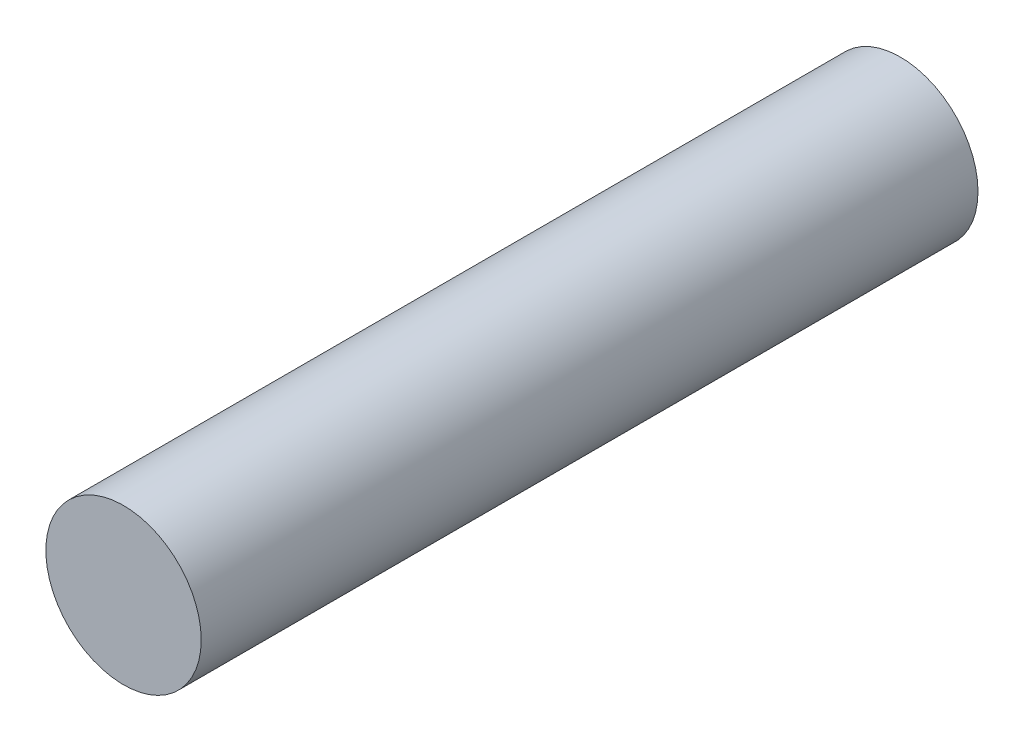
ISO-10303-21;
HEADER;
FILE_DESCRIPTION(('STEP AP214'),'2;1');
FILE_NAME('part.step','',(''),(''),'','','');
FILE_SCHEMA(('AUTOMOTIVE_DESIGN { 1 0 10303 214 1 1 1 1 }'));
ENDSEC;
DATA;
#1=APPLICATION_CONTEXT('core data for automotive mechanical design processes');
#2=APPLICATION_PROTOCOL_DEFINITION('international standard','automotive_design',2000,#1);
#3=PRODUCT_CONTEXT('',#1,'mechanical');
#4=PRODUCT('Part','Part','',(#3));
#5=PRODUCT_RELATED_PRODUCT_CATEGORY('part','',(#4));
#6=PRODUCT_DEFINITION_FORMATION('','',#4);
#7=PRODUCT_DEFINITION_CONTEXT('part definition',#1,'design');
#8=PRODUCT_DEFINITION('design','',#6,#7);
#9=PRODUCT_DEFINITION_SHAPE('','',#8);
#10=(LENGTH_UNIT() NAMED_UNIT(*) SI_UNIT(.MILLI.,.METRE.));
#11=(NAMED_UNIT(*) PLANE_ANGLE_UNIT() SI_UNIT($,.RADIAN.));
#12=(NAMED_UNIT(*) SI_UNIT($,.STERADIAN.) SOLID_ANGLE_UNIT());
#13=UNCERTAINTY_MEASURE_WITH_UNIT(LENGTH_MEASURE(1.E-05),#10,'distance_accuracy_value','');
#14=(GEOMETRIC_REPRESENTATION_CONTEXT(3) GLOBAL_UNCERTAINTY_ASSIGNED_CONTEXT((#13)) GLOBAL_UNIT_ASSIGNED_CONTEXT((#10,
#11,#12)) REPRESENTATION_CONTEXT('',''));
#15=CARTESIAN_POINT('',(0.,0.,0.));
#16=DIRECTION('',(0.,0.,1.));
#17=DIRECTION('',(1.,0.,0.));
#18=AXIS2_PLACEMENT_3D('',#15,#16,#17);
#19=CARTESIAN_POINT('',(0.,0.,31.75));
#20=DIRECTION('',(0.,0.,-1.));
#21=DIRECTION('',(-1.,0.,0.));
#22=AXIS2_PLACEMENT_3D('',#19,#20,#21);
#23=CYLINDRICAL_SURFACE('',#22,6.35);
#24=CARTESIAN_POINT('',(0.,0.,31.75));
#25=DIRECTION('',(0.,0.,1.));
#26=DIRECTION('',(1.,0.,0.));
#27=AXIS2_PLACEMENT_3D('',#24,#25,#26);
#28=CIRCLE('',#27,6.35);
#29=CARTESIAN_POINT('',(6.35,0.,31.75));
#30=VERTEX_POINT('',#29);
#31=EDGE_CURVE('E10',#30,#30,#28,.T.);
#32=ORIENTED_EDGE('',*,*,#31,.F.);
#33=EDGE_LOOP('',(#32));
#34=FACE_BOUND('',#33,.T.);
#35=CARTESIAN_POINT('',(0.,0.,-31.75));
#36=DIRECTION('',(0.,0.,1.));
#37=DIRECTION('',(1.,0.,0.));
#38=AXIS2_PLACEMENT_3D('',#35,#36,#37);
#39=CIRCLE('',#38,6.35);
#40=CARTESIAN_POINT('',(6.35,0.,-31.75));
#41=VERTEX_POINT('',#40);
#42=EDGE_CURVE('E40',#41,#41,#39,.T.);
#43=ORIENTED_EDGE('',*,*,#42,.T.);
#44=EDGE_LOOP('',(#43));
#45=FACE_BOUND('',#44,.T.);
#46=ADVANCED_FACE('F37',(#34,#45),#23,.T.);
#47=CARTESIAN_POINT('',(0.,0.,31.75));
#48=DIRECTION('',(0.,0.,1.));
#49=DIRECTION('',(1.,0.,0.));
#50=AXIS2_PLACEMENT_3D('',#47,#48,#49);
#51=PLANE('',#50);
#52=ORIENTED_EDGE('',*,*,#31,.T.);
#53=EDGE_LOOP('',(#52));
#54=FACE_BOUND('',#53,.T.);
#55=ADVANCED_FACE('F54',(#54),#51,.T.);
#56=CARTESIAN_POINT('',(0.,0.,-31.75));
#57=DIRECTION('',(0.,0.,1.));
#58=DIRECTION('',(1.,0.,0.));
#59=AXIS2_PLACEMENT_3D('',#56,#57,#58);
#60=PLANE('',#59);
#61=ORIENTED_EDGE('',*,*,#42,.F.);
#62=EDGE_LOOP('',(#61));
#63=FACE_BOUND('',#62,.T.);
#64=ADVANCED_FACE('F52',(#63),#60,.F.);
#65=CLOSED_SHELL('',(#46,#55,#64));
#66=MANIFOLD_SOLID_BREP('B2',#65);
#67=ADVANCED_BREP_SHAPE_REPRESENTATION('',(#18,#66),#14);
#68=SHAPE_DEFINITION_REPRESENTATION(#9,#67);
ENDSEC;
END-ISO-10303-21;
